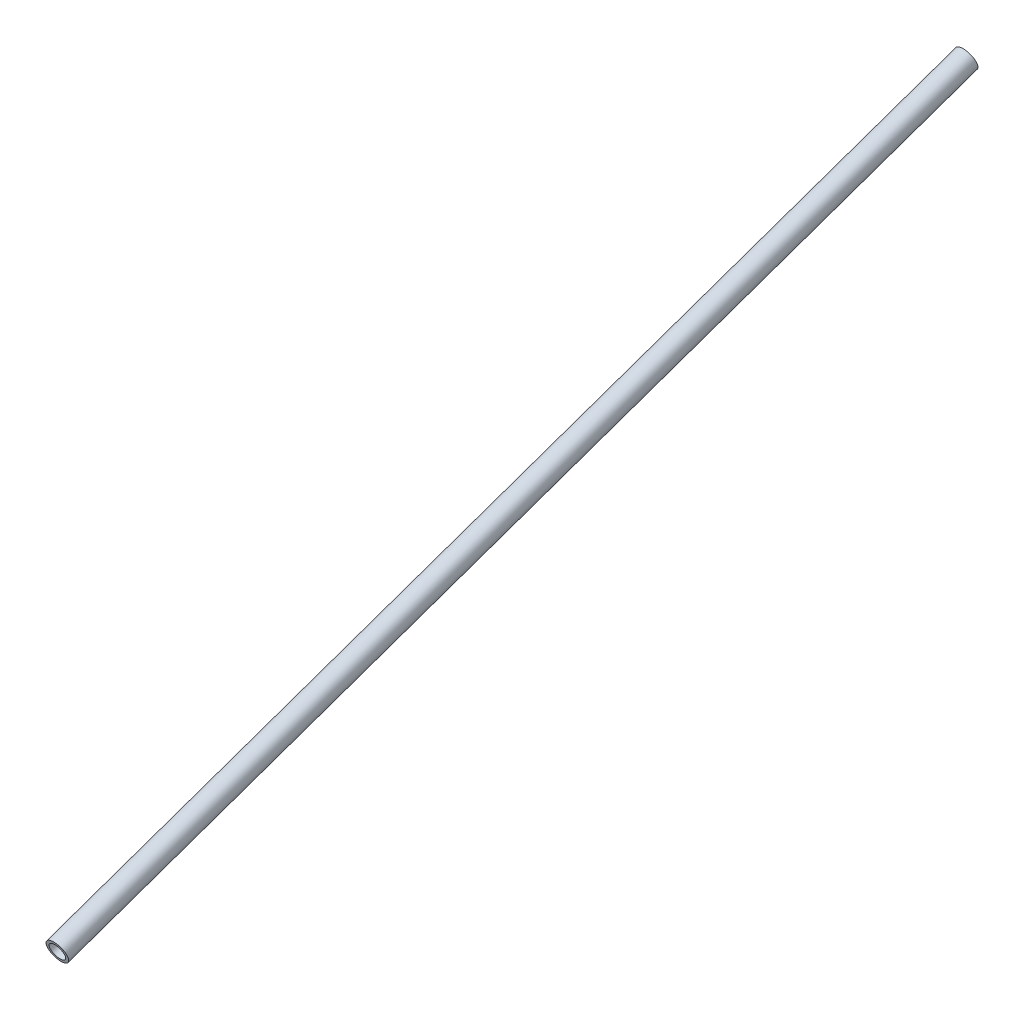
ISO-10303-21;
HEADER;
FILE_DESCRIPTION(('STEP AP214'),'2;1');
FILE_NAME('part.step','',(''),(''),'','','');
FILE_SCHEMA(('AUTOMOTIVE_DESIGN { 1 0 10303 214 1 1 1 1 }'));
ENDSEC;
DATA;
#1=APPLICATION_CONTEXT('core data for automotive mechanical design processes');
#2=APPLICATION_PROTOCOL_DEFINITION('international standard','automotive_design',2000,#1);
#3=PRODUCT_CONTEXT('',#1,'mechanical');
#4=PRODUCT('Part','Part','',(#3));
#5=PRODUCT_RELATED_PRODUCT_CATEGORY('part','',(#4));
#6=PRODUCT_DEFINITION_FORMATION('','',#4);
#7=PRODUCT_DEFINITION_CONTEXT('part definition',#1,'design');
#8=PRODUCT_DEFINITION('design','',#6,#7);
#9=PRODUCT_DEFINITION_SHAPE('','',#8);
#10=(LENGTH_UNIT() NAMED_UNIT(*) SI_UNIT(.MILLI.,.METRE.));
#11=(NAMED_UNIT(*) PLANE_ANGLE_UNIT() SI_UNIT($,.RADIAN.));
#12=(NAMED_UNIT(*) SI_UNIT($,.STERADIAN.) SOLID_ANGLE_UNIT());
#13=UNCERTAINTY_MEASURE_WITH_UNIT(LENGTH_MEASURE(1.E-05),#10,'distance_accuracy_value','');
#14=(GEOMETRIC_REPRESENTATION_CONTEXT(3) GLOBAL_UNCERTAINTY_ASSIGNED_CONTEXT((#13)) GLOBAL_UNIT_ASSIGNED_CONTEXT((#10,
#11,#12)) REPRESENTATION_CONTEXT('',''));
#15=CARTESIAN_POINT('',(0.,0.,0.));
#16=DIRECTION('',(0.,0.,1.));
#17=DIRECTION('',(1.,0.,0.));
#18=AXIS2_PLACEMENT_3D('',#15,#16,#17);
#19=CARTESIAN_POINT('',(0.,328.979839778778,-834.43063559274));
#20=DIRECTION('',(0.,-0.331107148695618,0.943593162375956));
#21=DIRECTION('',(0.,-0.943593162375957,-0.331107148695618));
#22=AXIS2_PLACEMENT_3D('',#19,#20,#21);
#23=CYLINDRICAL_SURFACE('',#22,6.985);
#24=CARTESIAN_POINT('',(0.,328.979839778778,-834.43063559274));
#25=DIRECTION('',(0.,0.331107148695618,-0.943593162375957));
#26=DIRECTION('',(0.,0.943593162375957,0.331107148695618));
#27=AXIS2_PLACEMENT_3D('',#24,#25,#26);
#28=CIRCLE('',#27,6.985);
#29=CARTESIAN_POINT('',(0.,335.570838017974,-832.117852159101));
#30=VERTEX_POINT('',#29);
#31=EDGE_CURVE('E51',#30,#30,#28,.T.);
#32=ORIENTED_EDGE('',*,*,#31,.T.);
#33=EDGE_LOOP('',(#32));
#34=FACE_BOUND('',#33,.T.);
#35=CARTESIAN_POINT('',(0.,47.1990718488197,-31.4083905122494));
#36=DIRECTION('',(0.,0.331107148695618,-0.943593162375957));
#37=DIRECTION('',(0.,0.943593162375957,0.331107148695618));
#38=AXIS2_PLACEMENT_3D('',#35,#36,#37);
#39=CIRCLE('',#38,6.985);
#40=CARTESIAN_POINT('',(0.,53.7900700880158,-29.0956070786105));
#41=VERTEX_POINT('',#40);
#42=EDGE_CURVE('E57',#41,#41,#39,.T.);
#43=ORIENTED_EDGE('',*,*,#42,.F.);
#44=EDGE_LOOP('',(#43));
#45=FACE_BOUND('',#44,.T.);
#46=ADVANCED_FACE('F44',(#34,#45),#23,.F.);
#47=CARTESIAN_POINT('',(0.,328.979839778778,-834.43063559274));
#48=DIRECTION('',(0.,-0.331107148695618,0.943593162375956));
#49=DIRECTION('',(0.,-0.943593162375957,-0.331107148695618));
#50=AXIS2_PLACEMENT_3D('',#47,#48,#49);
#51=CYLINDRICAL_SURFACE('',#50,9.525);
#52=CARTESIAN_POINT('',(0.,328.979839778778,-834.43063559274));
#53=DIRECTION('',(0.,0.331107148695618,-0.943593162375957));
#54=DIRECTION('',(0.,0.943593162375957,0.331107148695618));
#55=AXIS2_PLACEMENT_3D('',#52,#53,#54);
#56=CIRCLE('',#55,9.525);
#57=CARTESIAN_POINT('',(0.,337.967564650409,-831.276840001414));
#58=VERTEX_POINT('',#57);
#59=EDGE_CURVE('E11',#58,#58,#56,.T.);
#60=ORIENTED_EDGE('',*,*,#59,.F.);
#61=EDGE_LOOP('',(#60));
#62=FACE_BOUND('',#61,.T.);
#63=CARTESIAN_POINT('',(0.,47.1990718488197,-31.4083905122494));
#64=DIRECTION('',(0.,0.331107148695618,-0.943593162375957));
#65=DIRECTION('',(0.,0.943593162375957,0.331107148695618));
#66=AXIS2_PLACEMENT_3D('',#63,#64,#65);
#67=CIRCLE('',#66,9.525);
#68=CARTESIAN_POINT('',(0.,56.1867967204507,-28.2545949209237));
#69=VERTEX_POINT('',#68);
#70=EDGE_CURVE('E47',#69,#69,#67,.T.);
#71=ORIENTED_EDGE('',*,*,#70,.T.);
#72=EDGE_LOOP('',(#71));
#73=FACE_BOUND('',#72,.T.);
#74=ADVANCED_FACE('F64',(#62,#73),#51,.T.);
#75=CARTESIAN_POINT('',(0.,328.979839778778,-834.43063559274));
#76=DIRECTION('',(0.,0.331107148695618,-0.943593162375957));
#77=DIRECTION('',(0.,0.943593162375957,0.331107148695618));
#78=AXIS2_PLACEMENT_3D('',#75,#76,#77);
#79=PLANE('',#78);
#80=ORIENTED_EDGE('',*,*,#31,.F.);
#81=EDGE_LOOP('',(#80));
#82=FACE_BOUND('',#81,.T.);
#83=ORIENTED_EDGE('',*,*,#59,.T.);
#84=EDGE_LOOP('',(#83));
#85=FACE_BOUND('',#84,.T.);
#86=ADVANCED_FACE('F68',(#82,#85),#79,.T.);
#87=CARTESIAN_POINT('',(0.,47.1990718488197,-31.4083905122494));
#88=DIRECTION('',(0.,0.331107148695618,-0.943593162375957));
#89=DIRECTION('',(0.,0.943593162375957,0.331107148695618));
#90=AXIS2_PLACEMENT_3D('',#87,#88,#89);
#91=PLANE('',#90);
#92=ORIENTED_EDGE('',*,*,#42,.T.);
#93=EDGE_LOOP('',(#92));
#94=FACE_BOUND('',#93,.T.);
#95=ORIENTED_EDGE('',*,*,#70,.F.);
#96=EDGE_LOOP('',(#95));
#97=FACE_BOUND('',#96,.T.);
#98=ADVANCED_FACE('F66',(#94,#97),#91,.F.);
#99=CLOSED_SHELL('',(#46,#74,#86,#98));
#100=MANIFOLD_SOLID_BREP('B2',#99);
#101=ADVANCED_BREP_SHAPE_REPRESENTATION('',(#18,#100),#14);
#102=SHAPE_DEFINITION_REPRESENTATION(#9,#101);
ENDSEC;
END-ISO-10303-21;
